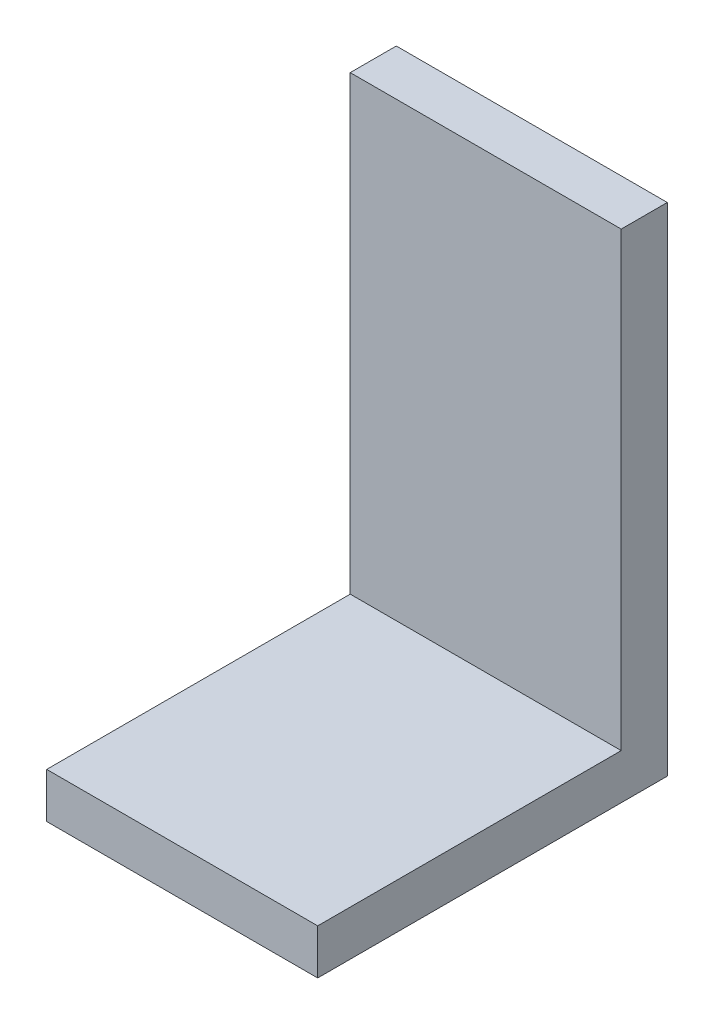
ISO-10303-21;
HEADER;
FILE_DESCRIPTION(('STEP AP214'),'2;1');
FILE_NAME('part.step','',(''),(''),'','','');
FILE_SCHEMA(('AUTOMOTIVE_DESIGN { 1 0 10303 214 1 1 1 1 }'));
ENDSEC;
DATA;
#1=APPLICATION_CONTEXT('core data for automotive mechanical design processes');
#2=APPLICATION_PROTOCOL_DEFINITION('international standard','automotive_design',2000,#1);
#3=PRODUCT_CONTEXT('',#1,'mechanical');
#4=PRODUCT('Part','Part','',(#3));
#5=PRODUCT_RELATED_PRODUCT_CATEGORY('part','',(#4));
#6=PRODUCT_DEFINITION_FORMATION('','',#4);
#7=PRODUCT_DEFINITION_CONTEXT('part definition',#1,'design');
#8=PRODUCT_DEFINITION('design','',#6,#7);
#9=PRODUCT_DEFINITION_SHAPE('','',#8);
#10=(LENGTH_UNIT() NAMED_UNIT(*) SI_UNIT(.MILLI.,.METRE.));
#11=(NAMED_UNIT(*) PLANE_ANGLE_UNIT() SI_UNIT($,.RADIAN.));
#12=(NAMED_UNIT(*) SI_UNIT($,.STERADIAN.) SOLID_ANGLE_UNIT());
#13=UNCERTAINTY_MEASURE_WITH_UNIT(LENGTH_MEASURE(1.E-05),#10,'distance_accuracy_value','');
#14=(GEOMETRIC_REPRESENTATION_CONTEXT(3) GLOBAL_UNCERTAINTY_ASSIGNED_CONTEXT((#13)) GLOBAL_UNIT_ASSIGNED_CONTEXT((#10,
#11,#12)) REPRESENTATION_CONTEXT('',''));
#15=CARTESIAN_POINT('',(0.,0.,0.));
#16=DIRECTION('',(0.,0.,1.));
#17=DIRECTION('',(1.,0.,0.));
#18=AXIS2_PLACEMENT_3D('',#15,#16,#17);
#19=CARTESIAN_POINT('',(0.4,-4.55,0.));
#20=DIRECTION('',(1.,0.,0.));
#21=DIRECTION('',(0.,0.,1.));
#22=AXIS2_PLACEMENT_3D('',#19,#20,#21);
#23=PLANE('',#22);
#24=DIRECTION('',(0.,-1.,0.));
#25=VECTOR('',#24,1.);
#26=CARTESIAN_POINT('',(0.4,-4.,0.));
#27=LINE('',#26,#25);
#28=CARTESIAN_POINT('',(0.4,-4.,0.));
#29=VERTEX_POINT('',#28);
#30=CARTESIAN_POINT('',(0.4,-4.55,0.));
#31=VERTEX_POINT('',#30);
#32=EDGE_CURVE('E11',#29,#31,#27,.T.);
#33=ORIENTED_EDGE('',*,*,#32,.F.);
#34=DIRECTION('',(0.,0.,-1.));
#35=VECTOR('',#34,1.);
#36=CARTESIAN_POINT('',(0.4,-4.,0.051));
#37=LINE('',#36,#35);
#38=CARTESIAN_POINT('',(0.4,-4.,0.051));
#39=VERTEX_POINT('',#38);
#40=EDGE_CURVE('E24',#39,#29,#37,.T.);
#41=ORIENTED_EDGE('',*,*,#40,.F.);
#42=DIRECTION('',(0.,1.,0.));
#43=VECTOR('',#42,1.);
#44=CARTESIAN_POINT('',(0.4,-4.5,0.051));
#45=LINE('',#44,#43);
#46=CARTESIAN_POINT('',(0.4,-4.5,0.051));
#47=VERTEX_POINT('',#46);
#48=EDGE_CURVE('E87',#47,#39,#45,.T.);
#49=ORIENTED_EDGE('',*,*,#48,.F.);
#50=DIRECTION('',(0.,0.,-1.));
#51=VECTOR('',#50,1.);
#52=CARTESIAN_POINT('',(0.4,-4.5,0.387));
#53=LINE('',#52,#51);
#54=CARTESIAN_POINT('',(0.4,-4.5,0.387));
#55=VERTEX_POINT('',#54);
#56=EDGE_CURVE('E114',#55,#47,#53,.T.);
#57=ORIENTED_EDGE('',*,*,#56,.F.);
#58=DIRECTION('',(0.,1.,0.));
#59=VECTOR('',#58,1.);
#60=CARTESIAN_POINT('',(0.4,-4.55,0.387));
#61=LINE('',#60,#59);
#62=CARTESIAN_POINT('',(0.4,-4.55,0.387));
#63=VERTEX_POINT('',#62);
#64=EDGE_CURVE('E111',#63,#55,#61,.T.);
#65=ORIENTED_EDGE('',*,*,#64,.F.);
#66=DIRECTION('',(0.,0.,1.));
#67=VECTOR('',#66,1.);
#68=CARTESIAN_POINT('',(0.4,-4.55,0.));
#69=LINE('',#68,#67);
#70=EDGE_CURVE('E108',#31,#63,#69,.T.);
#71=ORIENTED_EDGE('',*,*,#70,.F.);
#72=EDGE_LOOP('',(#33,#41,#49,#57,#65,#71));
#73=FACE_BOUND('',#72,.T.);
#74=ADVANCED_FACE('F17',(#73),#23,.T.);
#75=CARTESIAN_POINT('',(0.1,-4.,0.));
#76=DIRECTION('',(-1.,0.,0.));
#77=DIRECTION('',(0.,0.,1.));
#78=AXIS2_PLACEMENT_3D('',#75,#76,#77);
#79=PLANE('',#78);
#80=DIRECTION('',(0.,1.,0.));
#81=VECTOR('',#80,1.);
#82=CARTESIAN_POINT('',(0.1,-4.55,0.));
#83=LINE('',#82,#81);
#84=CARTESIAN_POINT('',(0.1,-4.55,0.));
#85=VERTEX_POINT('',#84);
#86=CARTESIAN_POINT('',(0.1,-4.,0.));
#87=VERTEX_POINT('',#86);
#88=EDGE_CURVE('E106',#85,#87,#83,.T.);
#89=ORIENTED_EDGE('',*,*,#88,.F.);
#90=DIRECTION('',(0.,0.,-1.));
#91=VECTOR('',#90,1.);
#92=CARTESIAN_POINT('',(0.1,-4.55,0.387));
#93=LINE('',#92,#91);
#94=CARTESIAN_POINT('',(0.1,-4.55,0.387));
#95=VERTEX_POINT('',#94);
#96=EDGE_CURVE('E103',#95,#85,#93,.T.);
#97=ORIENTED_EDGE('',*,*,#96,.F.);
#98=DIRECTION('',(0.,-1.,0.));
#99=VECTOR('',#98,1.);
#100=CARTESIAN_POINT('',(0.1,-4.5,0.387));
#101=LINE('',#100,#99);
#102=CARTESIAN_POINT('',(0.1,-4.5,0.387));
#103=VERTEX_POINT('',#102);
#104=EDGE_CURVE('E100',#103,#95,#101,.T.);
#105=ORIENTED_EDGE('',*,*,#104,.F.);
#106=DIRECTION('',(0.,0.,1.));
#107=VECTOR('',#106,1.);
#108=CARTESIAN_POINT('',(0.1,-4.5,0.051));
#109=LINE('',#108,#107);
#110=CARTESIAN_POINT('',(0.1,-4.5,0.051));
#111=VERTEX_POINT('',#110);
#112=EDGE_CURVE('E72',#111,#103,#109,.T.);
#113=ORIENTED_EDGE('',*,*,#112,.F.);
#114=DIRECTION('',(0.,-1.,0.));
#115=VECTOR('',#114,1.);
#116=CARTESIAN_POINT('',(0.1,-4.,0.051));
#117=LINE('',#116,#115);
#118=CARTESIAN_POINT('',(0.1,-4.,0.051));
#119=VERTEX_POINT('',#118);
#120=EDGE_CURVE('E66',#119,#111,#117,.T.);
#121=ORIENTED_EDGE('',*,*,#120,.F.);
#122=DIRECTION('',(0.,0.,1.));
#123=VECTOR('',#122,1.);
#124=CARTESIAN_POINT('',(0.1,-4.,0.));
#125=LINE('',#124,#123);
#126=EDGE_CURVE('E69',#87,#119,#125,.T.);
#127=ORIENTED_EDGE('',*,*,#126,.F.);
#128=EDGE_LOOP('',(#89,#97,#105,#113,#121,#127));
#129=FACE_BOUND('',#128,.T.);
#130=ADVANCED_FACE('F68',(#129),#79,.T.);
#131=CARTESIAN_POINT('',(0.4,-4.55,0.387));
#132=DIRECTION('',(0.,0.,1.));
#133=DIRECTION('',(0.,1.,0.));
#134=AXIS2_PLACEMENT_3D('',#131,#132,#133);
#135=PLANE('',#134);
#136=ORIENTED_EDGE('',*,*,#64,.T.);
#137=DIRECTION('',(1.,0.,0.));
#138=VECTOR('',#137,1.);
#139=CARTESIAN_POINT('',(0.1,-4.5,0.387));
#140=LINE('',#139,#138);
#141=EDGE_CURVE('E83',#103,#55,#140,.T.);
#142=ORIENTED_EDGE('',*,*,#141,.F.);
#143=ORIENTED_EDGE('',*,*,#104,.T.);
#144=DIRECTION('',(-1.,0.,0.));
#145=VECTOR('',#144,1.);
#146=CARTESIAN_POINT('',(0.4,-4.55,0.387));
#147=LINE('',#146,#145);
#148=EDGE_CURVE('E88',#63,#95,#147,.T.);
#149=ORIENTED_EDGE('',*,*,#148,.F.);
#150=EDGE_LOOP('',(#136,#142,#143,#149));
#151=FACE_BOUND('',#150,.T.);
#152=ADVANCED_FACE('F125',(#151),#135,.T.);
#153=CARTESIAN_POINT('',(0.4,-4.5,0.051));
#154=DIRECTION('',(0.,0.,1.));
#155=DIRECTION('',(0.,1.,0.));
#156=AXIS2_PLACEMENT_3D('',#153,#154,#155);
#157=PLANE('',#156);
#158=ORIENTED_EDGE('',*,*,#48,.T.);
#159=DIRECTION('',(1.,0.,0.));
#160=VECTOR('',#159,1.);
#161=CARTESIAN_POINT('',(0.1,-4.,0.051));
#162=LINE('',#161,#160);
#163=EDGE_CURVE('E81',#119,#39,#162,.T.);
#164=ORIENTED_EDGE('',*,*,#163,.F.);
#165=ORIENTED_EDGE('',*,*,#120,.T.);
#166=DIRECTION('',(-1.,0.,0.));
#167=VECTOR('',#166,1.);
#168=CARTESIAN_POINT('',(0.4,-4.5,0.051));
#169=LINE('',#168,#167);
#170=EDGE_CURVE('E89',#47,#111,#169,.T.);
#171=ORIENTED_EDGE('',*,*,#170,.F.);
#172=EDGE_LOOP('',(#158,#164,#165,#171));
#173=FACE_BOUND('',#172,.T.);
#174=ADVANCED_FACE('F86',(#173),#157,.T.);
#175=CARTESIAN_POINT('',(0.1,-4.55,0.));
#176=DIRECTION('',(0.,-1.,0.));
#177=DIRECTION('',(0.,0.,1.));
#178=AXIS2_PLACEMENT_3D('',#175,#176,#177);
#179=PLANE('',#178);
#180=DIRECTION('',(-1.,0.,0.));
#181=VECTOR('',#180,1.);
#182=CARTESIAN_POINT('',(0.4,-4.55,0.));
#183=LINE('',#182,#181);
#184=EDGE_CURVE('E93',#31,#85,#183,.T.);
#185=ORIENTED_EDGE('',*,*,#184,.F.);
#186=ORIENTED_EDGE('',*,*,#70,.T.);
#187=ORIENTED_EDGE('',*,*,#148,.T.);
#188=ORIENTED_EDGE('',*,*,#96,.T.);
#189=EDGE_LOOP('',(#185,#186,#187,#188));
#190=FACE_BOUND('',#189,.T.);
#191=ADVANCED_FACE('F121',(#190),#179,.T.);
#192=CARTESIAN_POINT('',(0.4,-4.,0.));
#193=DIRECTION('',(0.,1.,0.));
#194=DIRECTION('',(0.,0.,1.));
#195=AXIS2_PLACEMENT_3D('',#192,#193,#194);
#196=PLANE('',#195);
#197=DIRECTION('',(1.,0.,0.));
#198=VECTOR('',#197,1.);
#199=CARTESIAN_POINT('',(0.1,-4.,0.));
#200=LINE('',#199,#198);
#201=EDGE_CURVE('E82',#87,#29,#200,.T.);
#202=ORIENTED_EDGE('',*,*,#201,.F.);
#203=ORIENTED_EDGE('',*,*,#126,.T.);
#204=ORIENTED_EDGE('',*,*,#163,.T.);
#205=ORIENTED_EDGE('',*,*,#40,.T.);
#206=EDGE_LOOP('',(#202,#203,#204,#205));
#207=FACE_BOUND('',#206,.T.);
#208=ADVANCED_FACE('F80',(#207),#196,.T.);
#209=CARTESIAN_POINT('',(0.4,-4.5,0.051));
#210=DIRECTION('',(0.,1.,0.));
#211=DIRECTION('',(0.,0.,1.));
#212=AXIS2_PLACEMENT_3D('',#209,#210,#211);
#213=PLANE('',#212);
#214=ORIENTED_EDGE('',*,*,#170,.T.);
#215=ORIENTED_EDGE('',*,*,#112,.T.);
#216=ORIENTED_EDGE('',*,*,#141,.T.);
#217=ORIENTED_EDGE('',*,*,#56,.T.);
#218=EDGE_LOOP('',(#214,#215,#216,#217));
#219=FACE_BOUND('',#218,.T.);
#220=ADVANCED_FACE('F127',(#219),#213,.T.);
#221=CARTESIAN_POINT('',(0.1,-4.55,0.));
#222=DIRECTION('',(0.,0.,-1.));
#223=DIRECTION('',(0.,1.,0.));
#224=AXIS2_PLACEMENT_3D('',#221,#222,#223);
#225=PLANE('',#224);
#226=ORIENTED_EDGE('',*,*,#88,.T.);
#227=ORIENTED_EDGE('',*,*,#201,.T.);
#228=ORIENTED_EDGE('',*,*,#32,.T.);
#229=ORIENTED_EDGE('',*,*,#184,.T.);
#230=EDGE_LOOP('',(#226,#227,#228,#229));
#231=FACE_BOUND('',#230,.T.);
#232=ADVANCED_FACE('F117',(#231),#225,.T.);
#233=CLOSED_SHELL('',(#74,#130,#152,#174,#191,#208,#220,#232));
#234=MANIFOLD_SOLID_BREP('B1',#233);
#235=ADVANCED_BREP_SHAPE_REPRESENTATION('',(#18,#234),#14);
#236=SHAPE_DEFINITION_REPRESENTATION(#9,#235);
ENDSEC;
END-ISO-10303-21;
